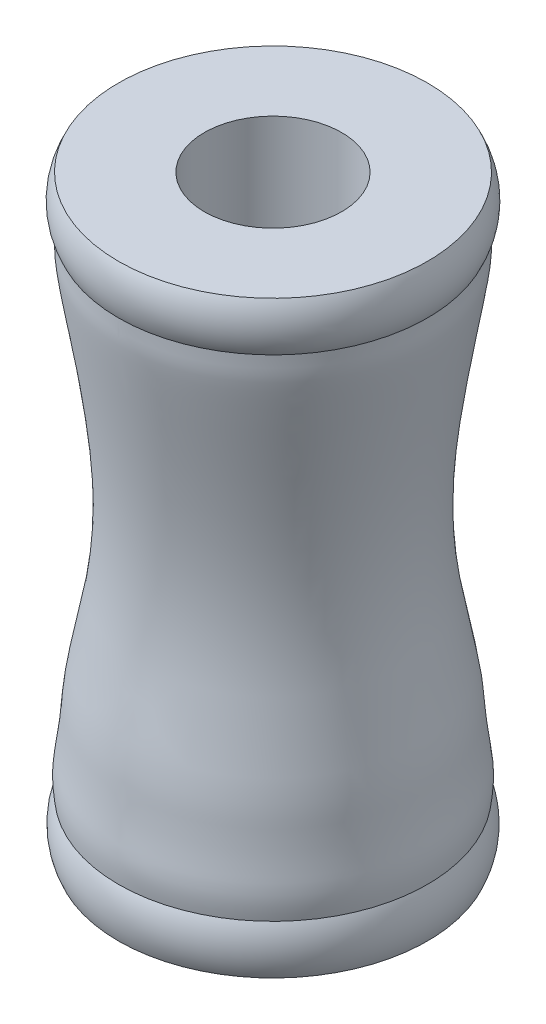
ISO-10303-21;
HEADER;
FILE_DESCRIPTION(('STEP AP214'),'2;1');
FILE_NAME('part.step','',(''),(''),'','','');
FILE_SCHEMA(('AUTOMOTIVE_DESIGN { 1 0 10303 214 1 1 1 1 }'));
ENDSEC;
DATA;
#1=APPLICATION_CONTEXT('core data for automotive mechanical design processes');
#2=APPLICATION_PROTOCOL_DEFINITION('international standard','automotive_design',2000,#1);
#3=PRODUCT_CONTEXT('',#1,'mechanical');
#4=PRODUCT('Part','Part','',(#3));
#5=PRODUCT_RELATED_PRODUCT_CATEGORY('part','',(#4));
#6=PRODUCT_DEFINITION_FORMATION('','',#4);
#7=PRODUCT_DEFINITION_CONTEXT('part definition',#1,'design');
#8=PRODUCT_DEFINITION('design','',#6,#7);
#9=PRODUCT_DEFINITION_SHAPE('','',#8);
#10=(LENGTH_UNIT() NAMED_UNIT(*) SI_UNIT(.MILLI.,.METRE.));
#11=(NAMED_UNIT(*) PLANE_ANGLE_UNIT() SI_UNIT($,.RADIAN.));
#12=(NAMED_UNIT(*) SI_UNIT($,.STERADIAN.) SOLID_ANGLE_UNIT());
#13=UNCERTAINTY_MEASURE_WITH_UNIT(LENGTH_MEASURE(1.E-05),#10,'distance_accuracy_value','');
#14=(GEOMETRIC_REPRESENTATION_CONTEXT(3) GLOBAL_UNCERTAINTY_ASSIGNED_CONTEXT((#13)) GLOBAL_UNIT_ASSIGNED_CONTEXT((#10,
#11,#12)) REPRESENTATION_CONTEXT('',''));
#15=CARTESIAN_POINT('',(0.,0.,0.));
#16=DIRECTION('',(0.,0.,1.));
#17=DIRECTION('',(1.,0.,0.));
#18=AXIS2_PLACEMENT_3D('',#15,#16,#17);
#19=CARTESIAN_POINT('',(0.,5.59767368268254,-1.4));
#20=DIRECTION('',(0.,-1.,0.));
#21=DIRECTION('',(0.,0.,-1.));
#22=AXIS2_PLACEMENT_3D('',#19,#20,#21);
#23=PLANE('',#22);
#24=CARTESIAN_POINT('',(0.,5.59767368268254,0.));
#25=DIRECTION('',(0.,1.,0.));
#26=DIRECTION('',(0.,0.,1.));
#27=AXIS2_PLACEMENT_3D('',#24,#25,#26);
#28=CIRCLE('',#27,1.4);
#29=CARTESIAN_POINT('',(0.,5.59767368268254,1.4));
#30=VERTEX_POINT('',#29);
#31=EDGE_CURVE('E10',#30,#30,#28,.T.);
#32=ORIENTED_EDGE('',*,*,#31,.F.);
#33=EDGE_LOOP('',(#32));
#34=FACE_BOUND('',#33,.T.);
#35=CARTESIAN_POINT('',(0.,5.59767368268254,0.));
#36=DIRECTION('',(0.,1.,0.));
#37=DIRECTION('',(0.,0.,1.));
#38=AXIS2_PLACEMENT_3D('',#35,#36,#37);
#39=CIRCLE('',#38,3.15);
#40=CARTESIAN_POINT('',(0.,5.59767368268254,3.15));
#41=VERTEX_POINT('',#40);
#42=EDGE_CURVE('E46',#41,#41,#39,.T.);
#43=ORIENTED_EDGE('',*,*,#42,.T.);
#44=EDGE_LOOP('',(#43));
#45=FACE_BOUND('',#44,.T.);
#46=ADVANCED_FACE('F39',(#34,#45),#23,.F.);
#47=CARTESIAN_POINT('',(0.,5.09767368268254,0.));
#48=DIRECTION('',(0.,1.,0.));
#49=DIRECTION('',(0.,0.,1.));
#50=AXIS2_PLACEMENT_3D('',#47,#48,#49);
#51=TOROIDAL_SURFACE('',#50,2.17646295585756,1.0944287899711);
#52=ORIENTED_EDGE('',*,*,#42,.F.);
#53=EDGE_LOOP('',(#52));
#54=FACE_BOUND('',#53,.T.);
#55=CARTESIAN_POINT('',(0.,4.59767368268254,0.));
#56=DIRECTION('',(0.,1.,0.));
#57=DIRECTION('',(0.,0.,1.));
#58=AXIS2_PLACEMENT_3D('',#55,#56,#57);
#59=CIRCLE('',#58,3.15);
#60=CARTESIAN_POINT('',(0.,4.59767368268254,3.15));
#61=VERTEX_POINT('',#60);
#62=EDGE_CURVE('E51',#61,#61,#59,.T.);
#63=ORIENTED_EDGE('',*,*,#62,.T.);
#64=EDGE_LOOP('',(#63));
#65=FACE_BOUND('',#64,.T.);
#66=ADVANCED_FACE('F81',(#54,#65),#51,.T.);
#67=CARTESIAN_POINT('',(0.,-5.40232631731747,-3.15));
#68=CARTESIAN_POINT('',(0.,-4.84246844893464,-3.22744731946394));
#69=CARTESIAN_POINT('',(0.,-4.77011645546345,-3.11018361790507));
#70=CARTESIAN_POINT('',(0.,-3.20416039830012,-3.01191675572342));
#71=CARTESIAN_POINT('',(0.,-1.46391612434349,-2.57704664119905));
#72=CARTESIAN_POINT('',(0.,0.552799712343612,-2.54858085728003));
#73=CARTESIAN_POINT('',(0.,3.06941636416576,-2.97026486969747));
#74=CARTESIAN_POINT('',(0.,4.15691940705208,-3.1650903756335));
#75=CARTESIAN_POINT('',(0.,4.35161718640553,-3.14746796129713));
#76=CARTESIAN_POINT('',(0.,4.59767368268254,-3.15));
#77=B_SPLINE_CURVE_WITH_KNOTS('',3,(#67,#68,#69,#70,#71,#72,#73,#74,#75,#76),.UNSPECIFIED.,.F.,
.F.,(4,1,1,1,1,1,1,4),(0.,0.218925331444716,0.256641961356668,0.377166299119522,
0.601373770985568,0.774754468271785,0.935388051010228,1.),.UNSPECIFIED.);
#78=CARTESIAN_POINT('',(0.,0.,0.));
#79=DIRECTION('',(0.,1.,0.));
#80=AXIS1_PLACEMENT('',#78,#79);
#81=SURFACE_OF_REVOLUTION('',#77,#80);
#82=ORIENTED_EDGE('',*,*,#62,.F.);
#83=EDGE_LOOP('',(#82));
#84=FACE_BOUND('',#83,.T.);
#85=CARTESIAN_POINT('',(0.,-5.40232631731746,0.));
#86=DIRECTION('',(0.,1.,0.));
#87=DIRECTION('',(0.,0.,1.));
#88=AXIS2_PLACEMENT_3D('',#85,#86,#87);
#89=CIRCLE('',#88,3.15);
#90=CARTESIAN_POINT('',(0.,-5.40232631731746,3.15));
#91=VERTEX_POINT('',#90);
#92=EDGE_CURVE('E56',#91,#91,#89,.T.);
#93=ORIENTED_EDGE('',*,*,#92,.T.);
#94=EDGE_LOOP('',(#93));
#95=FACE_BOUND('',#94,.T.);
#96=ADVANCED_FACE('F77',(#84,#95),#81,.T.);
#97=CARTESIAN_POINT('',(0.,-5.90232631731746,0.));
#98=DIRECTION('',(0.,1.,0.));
#99=DIRECTION('',(0.,0.,1.));
#100=AXIS2_PLACEMENT_3D('',#97,#98,#99);
#101=TOROIDAL_SURFACE('',#100,2.07050158616672,1.18967088956087);
#102=ORIENTED_EDGE('',*,*,#92,.F.);
#103=EDGE_LOOP('',(#102));
#104=FACE_BOUND('',#103,.T.);
#105=CARTESIAN_POINT('',(0.,-6.40232631731746,0.));
#106=DIRECTION('',(0.,1.,0.));
#107=DIRECTION('',(0.,0.,1.));
#108=AXIS2_PLACEMENT_3D('',#105,#106,#107);
#109=CIRCLE('',#108,3.15);
#110=CARTESIAN_POINT('',(0.,-6.40232631731746,3.15));
#111=VERTEX_POINT('',#110);
#112=EDGE_CURVE('E62',#111,#111,#109,.T.);
#113=ORIENTED_EDGE('',*,*,#112,.T.);
#114=EDGE_LOOP('',(#113));
#115=FACE_BOUND('',#114,.T.);
#116=ADVANCED_FACE('F80',(#104,#115),#101,.T.);
#117=CARTESIAN_POINT('',(0.,-6.40232631731746,-1.4));
#118=DIRECTION('',(0.,1.,0.));
#119=DIRECTION('',(0.,0.,1.));
#120=AXIS2_PLACEMENT_3D('',#117,#118,#119);
#121=PLANE('',#120);
#122=ORIENTED_EDGE('',*,*,#112,.F.);
#123=EDGE_LOOP('',(#122));
#124=FACE_BOUND('',#123,.T.);
#125=CARTESIAN_POINT('',(0.,-6.40232631731746,0.));
#126=DIRECTION('',(0.,1.,0.));
#127=DIRECTION('',(0.,0.,1.));
#128=AXIS2_PLACEMENT_3D('',#125,#126,#127);
#129=CIRCLE('',#128,1.4);
#130=CARTESIAN_POINT('',(0.,-6.40232631731746,1.4));
#131=VERTEX_POINT('',#130);
#132=EDGE_CURVE('E66',#131,#131,#129,.T.);
#133=ORIENTED_EDGE('',*,*,#132,.T.);
#134=EDGE_LOOP('',(#133));
#135=FACE_BOUND('',#134,.T.);
#136=ADVANCED_FACE('F97',(#124,#135),#121,.F.);
#137=CARTESIAN_POINT('',(0.,0.,0.));
#138=DIRECTION('',(0.,1.,0.));
#139=DIRECTION('',(0.,0.,1.));
#140=AXIS2_PLACEMENT_3D('',#137,#138,#139);
#141=CYLINDRICAL_SURFACE('',#140,1.4);
#142=ORIENTED_EDGE('',*,*,#132,.F.);
#143=EDGE_LOOP('',(#142));
#144=FACE_BOUND('',#143,.T.);
#145=ORIENTED_EDGE('',*,*,#31,.T.);
#146=EDGE_LOOP('',(#145));
#147=FACE_BOUND('',#146,.T.);
#148=ADVANCED_FACE('F102',(#144,#147),#141,.F.);
#149=CLOSED_SHELL('',(#46,#66,#96,#116,#136,#148));
#150=MANIFOLD_SOLID_BREP('B2',#149);
#151=ADVANCED_BREP_SHAPE_REPRESENTATION('',(#18,#150),#14);
#152=SHAPE_DEFINITION_REPRESENTATION(#9,#151);
ENDSEC;
END-ISO-10303-21;
